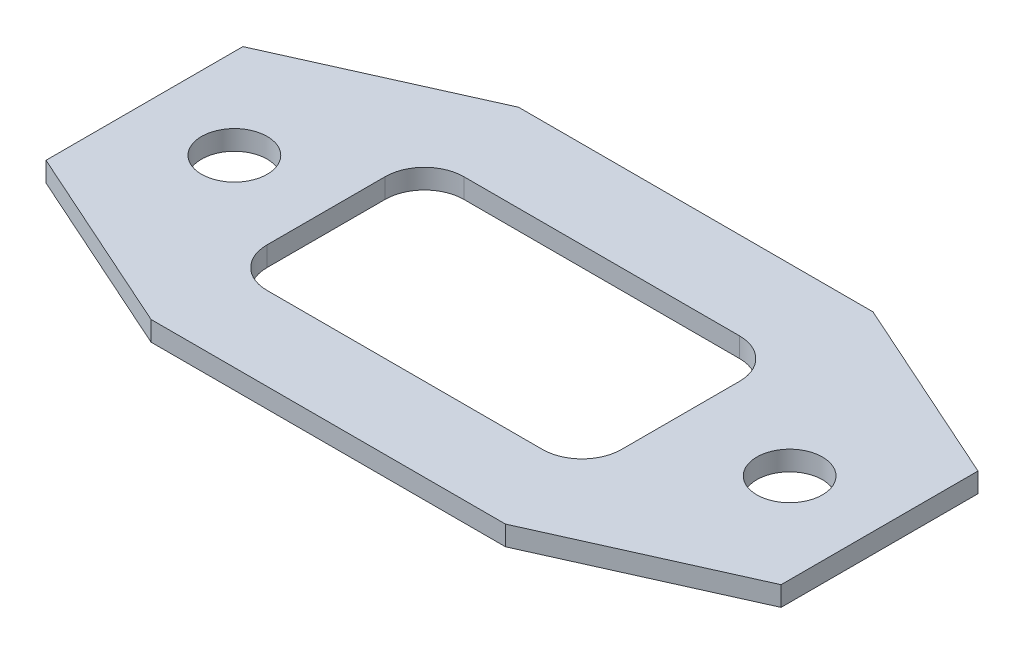
ISO-10303-21;
HEADER;
FILE_DESCRIPTION(('STEP AP214'),'2;1');
FILE_NAME('part.step','',(''),(''),'','','');
FILE_SCHEMA(('AUTOMOTIVE_DESIGN { 1 0 10303 214 1 1 1 1 }'));
ENDSEC;
DATA;
#1=APPLICATION_CONTEXT('core data for automotive mechanical design processes');
#2=APPLICATION_PROTOCOL_DEFINITION('international standard','automotive_design',2000,#1);
#3=PRODUCT_CONTEXT('',#1,'mechanical');
#4=PRODUCT('Part','Part','',(#3));
#5=PRODUCT_RELATED_PRODUCT_CATEGORY('part','',(#4));
#6=PRODUCT_DEFINITION_FORMATION('','',#4);
#7=PRODUCT_DEFINITION_CONTEXT('part definition',#1,'design');
#8=PRODUCT_DEFINITION('design','',#6,#7);
#9=PRODUCT_DEFINITION_SHAPE('','',#8);
#10=(LENGTH_UNIT() NAMED_UNIT(*) SI_UNIT(.MILLI.,.METRE.));
#11=(NAMED_UNIT(*) PLANE_ANGLE_UNIT() SI_UNIT($,.RADIAN.));
#12=(NAMED_UNIT(*) SI_UNIT($,.STERADIAN.) SOLID_ANGLE_UNIT());
#13=UNCERTAINTY_MEASURE_WITH_UNIT(LENGTH_MEASURE(1.E-05),#10,'distance_accuracy_value','');
#14=(GEOMETRIC_REPRESENTATION_CONTEXT(3) GLOBAL_UNCERTAINTY_ASSIGNED_CONTEXT((#13)) GLOBAL_UNIT_ASSIGNED_CONTEXT((#10,
#11,#12)) REPRESENTATION_CONTEXT('',''));
#15=CARTESIAN_POINT('',(0.,0.,0.));
#16=DIRECTION('',(0.,0.,1.));
#17=DIRECTION('',(1.,0.,0.));
#18=AXIS2_PLACEMENT_3D('',#15,#16,#17);
#19=CARTESIAN_POINT('',(0.,1.5,0.));
#20=DIRECTION('',(0.,1.,0.));
#21=DIRECTION('',(0.,0.,1.));
#22=AXIS2_PLACEMENT_3D('',#19,#20,#21);
#23=PLANE('',#22);
#24=CARTESIAN_POINT('',(21.15,1.5,0.));
#25=DIRECTION('',(0.,1.,0.));
#26=DIRECTION('',(0.,0.,1.));
#27=AXIS2_PLACEMENT_3D('',#24,#25,#26);
#28=CIRCLE('',#27,2.50000000000001);
#29=CARTESIAN_POINT('',(21.15,1.5,2.50000000000001));
#30=VERTEX_POINT('',#29);
#31=EDGE_CURVE('E185',#30,#30,#28,.T.);
#32=ORIENTED_EDGE('',*,*,#31,.F.);
#33=EDGE_LOOP('',(#32));
#34=FACE_BOUND('',#33,.T.);
#35=DIRECTION('',(-0.912509324514951,0.,0.409055904092909));
#36=VECTOR('',#35,1.);
#37=CARTESIAN_POINT('',(-13.5,1.5,-14.));
#38=LINE('',#37,#36);
#39=CARTESIAN_POINT('',(-13.5,1.5,-14.));
#40=VERTEX_POINT('',#39);
#41=CARTESIAN_POINT('',(-28.,1.5,-7.5));
#42=VERTEX_POINT('',#41);
#43=EDGE_CURVE('E215',#40,#42,#38,.T.);
#44=ORIENTED_EDGE('',*,*,#43,.T.);
#45=DIRECTION('',(0.,0.,1.));
#46=VECTOR('',#45,1.);
#47=CARTESIAN_POINT('',(-28.,1.5,-7.5));
#48=LINE('',#47,#46);
#49=CARTESIAN_POINT('',(-28.,1.5,7.5));
#50=VERTEX_POINT('',#49);
#51=EDGE_CURVE('E218',#42,#50,#48,.T.);
#52=ORIENTED_EDGE('',*,*,#51,.T.);
#53=DIRECTION('',(0.912509324514951,0.,0.409055904092909));
#54=VECTOR('',#53,1.);
#55=CARTESIAN_POINT('',(-13.5,1.5,14.));
#56=LINE('',#55,#54);
#57=CARTESIAN_POINT('',(-13.5,1.5,14.));
#58=VERTEX_POINT('',#57);
#59=EDGE_CURVE('E221',#50,#58,#56,.T.);
#60=ORIENTED_EDGE('',*,*,#59,.T.);
#61=DIRECTION('',(1.,0.,0.));
#62=VECTOR('',#61,1.);
#63=CARTESIAN_POINT('',(-13.5,1.5,14.));
#64=LINE('',#63,#62);
#65=CARTESIAN_POINT('',(13.5,1.5,14.));
#66=VERTEX_POINT('',#65);
#67=EDGE_CURVE('E223',#58,#66,#64,.T.);
#68=ORIENTED_EDGE('',*,*,#67,.T.);
#69=DIRECTION('',(0.912509324514951,0.,-0.409055904092909));
#70=VECTOR('',#69,1.);
#71=CARTESIAN_POINT('',(13.5,1.5,14.));
#72=LINE('',#71,#70);
#73=CARTESIAN_POINT('',(28.,1.5,7.5));
#74=VERTEX_POINT('',#73);
#75=EDGE_CURVE('E225',#66,#74,#72,.T.);
#76=ORIENTED_EDGE('',*,*,#75,.T.);
#77=DIRECTION('',(0.,0.,-1.));
#78=VECTOR('',#77,1.);
#79=CARTESIAN_POINT('',(28.,1.5,-7.5));
#80=LINE('',#79,#78);
#81=CARTESIAN_POINT('',(28.,1.5,-7.5));
#82=VERTEX_POINT('',#81);
#83=EDGE_CURVE('E227',#74,#82,#80,.T.);
#84=ORIENTED_EDGE('',*,*,#83,.T.);
#85=DIRECTION('',(-0.912509324514951,0.,-0.409055904092909));
#86=VECTOR('',#85,1.);
#87=CARTESIAN_POINT('',(13.5,1.5,-14.));
#88=LINE('',#87,#86);
#89=CARTESIAN_POINT('',(13.5,1.5,-14.));
#90=VERTEX_POINT('',#89);
#91=EDGE_CURVE('E229',#82,#90,#88,.T.);
#92=ORIENTED_EDGE('',*,*,#91,.T.);
#93=DIRECTION('',(-1.,0.,0.));
#94=VECTOR('',#93,1.);
#95=CARTESIAN_POINT('',(-13.5,1.5,-14.));
#96=LINE('',#95,#94);
#97=EDGE_CURVE('E231',#90,#40,#96,.T.);
#98=ORIENTED_EDGE('',*,*,#97,.T.);
#99=EDGE_LOOP('',(#44,#52,#60,#68,#76,#84,#92,#98));
#100=FACE_BOUND('',#99,.T.);
#101=DIRECTION('',(-1.,0.,0.));
#102=VECTOR('',#101,1.);
#103=CARTESIAN_POINT('',(-11.,1.5,-7.33368340575071));
#104=LINE('',#103,#102);
#105=CARTESIAN_POINT('',(9.99999999999998,1.5,-7.33368340575071));
#106=VERTEX_POINT('',#105);
#107=CARTESIAN_POINT('',(-11.,1.5,-7.33368340575071));
#108=VERTEX_POINT('',#107);
#109=EDGE_CURVE('E155',#106,#108,#104,.T.);
#110=ORIENTED_EDGE('',*,*,#109,.F.);
#111=CARTESIAN_POINT('',(10.,1.5,-4.3336834057507));
#112=DIRECTION('',(0.,1.,0.));
#113=DIRECTION('',(0.,0.,1.));
#114=AXIS2_PLACEMENT_3D('',#111,#112,#113);
#115=CIRCLE('',#114,3.);
#116=CARTESIAN_POINT('',(13.,1.5,-4.33368340575068));
#117=VERTEX_POINT('',#116);
#118=EDGE_CURVE('E147',#117,#106,#115,.T.);
#119=ORIENTED_EDGE('',*,*,#118,.F.);
#120=DIRECTION('',(0.,0.,-1.));
#121=VECTOR('',#120,1.);
#122=CARTESIAN_POINT('',(13.,1.5,-4.33368340575068));
#123=LINE('',#122,#121);
#124=CARTESIAN_POINT('',(13.,1.5,4.66631659424928));
#125=VERTEX_POINT('',#124);
#126=EDGE_CURVE('E182',#125,#117,#123,.T.);
#127=ORIENTED_EDGE('',*,*,#126,.F.);
#128=CARTESIAN_POINT('',(10.,1.5,4.6663165942493));
#129=DIRECTION('',(0.,1.,0.));
#130=DIRECTION('',(0.,0.,1.));
#131=AXIS2_PLACEMENT_3D('',#128,#129,#130);
#132=CIRCLE('',#131,3.);
#133=CARTESIAN_POINT('',(9.99999999999997,1.5,7.6663165942493));
#134=VERTEX_POINT('',#133);
#135=EDGE_CURVE('E180',#134,#125,#132,.T.);
#136=ORIENTED_EDGE('',*,*,#135,.F.);
#137=DIRECTION('',(1.,0.,0.));
#138=VECTOR('',#137,1.);
#139=CARTESIAN_POINT('',(9.99999999999997,1.5,7.66631659424929));
#140=LINE('',#139,#138);
#141=CARTESIAN_POINT('',(-11.,1.5,7.66631659424929));
#142=VERTEX_POINT('',#141);
#143=EDGE_CURVE('E178',#142,#134,#140,.T.);
#144=ORIENTED_EDGE('',*,*,#143,.F.);
#145=CARTESIAN_POINT('',(-11.,1.5,4.66631659424929));
#146=DIRECTION('',(0.,1.,0.));
#147=DIRECTION('',(0.,0.,1.));
#148=AXIS2_PLACEMENT_3D('',#145,#146,#147);
#149=CIRCLE('',#148,3.);
#150=CARTESIAN_POINT('',(-14.,1.5,4.66631659424927));
#151=VERTEX_POINT('',#150);
#152=EDGE_CURVE('E176',#151,#142,#149,.T.);
#153=ORIENTED_EDGE('',*,*,#152,.F.);
#154=DIRECTION('',(0.,0.,1.));
#155=VECTOR('',#154,1.);
#156=CARTESIAN_POINT('',(-14.,1.5,4.66631659424927));
#157=LINE('',#156,#155);
#158=CARTESIAN_POINT('',(-14.,1.5,-4.33368340575069));
#159=VERTEX_POINT('',#158);
#160=EDGE_CURVE('E171',#159,#151,#157,.T.);
#161=ORIENTED_EDGE('',*,*,#160,.F.);
#162=CARTESIAN_POINT('',(-11.,1.5,-4.33368340575071));
#163=DIRECTION('',(0.,1.,0.));
#164=DIRECTION('',(0.,0.,1.));
#165=AXIS2_PLACEMENT_3D('',#162,#163,#164);
#166=CIRCLE('',#165,3.);
#167=EDGE_CURVE('E169',#108,#159,#166,.T.);
#168=ORIENTED_EDGE('',*,*,#167,.F.);
#169=EDGE_LOOP('',(#110,#119,#127,#136,#144,#153,#161,#168));
#170=FACE_BOUND('',#169,.T.);
#171=CARTESIAN_POINT('',(-21.15,1.5,0.));
#172=DIRECTION('',(0.,1.,0.));
#173=DIRECTION('',(0.,0.,1.));
#174=AXIS2_PLACEMENT_3D('',#171,#172,#173);
#175=CIRCLE('',#174,2.50000000000001);
#176=CARTESIAN_POINT('',(-21.15,1.5,2.50000000000001));
#177=VERTEX_POINT('',#176);
#178=EDGE_CURVE('E371',#177,#177,#175,.T.);
#179=ORIENTED_EDGE('',*,*,#178,.F.);
#180=EDGE_LOOP('',(#179));
#181=FACE_BOUND('',#180,.T.);
#182=ADVANCED_FACE('F34',(#34,#100,#170,#181),#23,.T.);
#183=CARTESIAN_POINT('',(0.,0.,0.));
#184=DIRECTION('',(0.,1.,0.));
#185=DIRECTION('',(0.,0.,1.));
#186=AXIS2_PLACEMENT_3D('',#183,#184,#185);
#187=PLANE('',#186);
#188=DIRECTION('',(-0.912509324514951,0.,0.409055904092909));
#189=VECTOR('',#188,1.);
#190=CARTESIAN_POINT('',(-13.5,0.,-14.));
#191=LINE('',#190,#189);
#192=CARTESIAN_POINT('',(-13.5,0.,-14.));
#193=VERTEX_POINT('',#192);
#194=CARTESIAN_POINT('',(-28.,0.,-7.5));
#195=VERTEX_POINT('',#194);
#196=EDGE_CURVE('E163',#193,#195,#191,.T.);
#197=ORIENTED_EDGE('',*,*,#196,.F.);
#198=DIRECTION('',(-1.,0.,0.));
#199=VECTOR('',#198,1.);
#200=CARTESIAN_POINT('',(-13.5,0.,-14.));
#201=LINE('',#200,#199);
#202=CARTESIAN_POINT('',(13.5,0.,-14.));
#203=VERTEX_POINT('',#202);
#204=EDGE_CURVE('E219',#203,#193,#201,.T.);
#205=ORIENTED_EDGE('',*,*,#204,.F.);
#206=DIRECTION('',(-0.912509324514951,0.,-0.409055904092909));
#207=VECTOR('',#206,1.);
#208=CARTESIAN_POINT('',(13.5,0.,-14.));
#209=LINE('',#208,#207);
#210=CARTESIAN_POINT('',(28.,0.,-7.5));
#211=VERTEX_POINT('',#210);
#212=EDGE_CURVE('E246',#211,#203,#209,.T.);
#213=ORIENTED_EDGE('',*,*,#212,.F.);
#214=DIRECTION('',(0.,0.,-1.));
#215=VECTOR('',#214,1.);
#216=CARTESIAN_POINT('',(28.,0.,-7.5));
#217=LINE('',#216,#215);
#218=CARTESIAN_POINT('',(28.,0.,7.5));
#219=VERTEX_POINT('',#218);
#220=EDGE_CURVE('E244',#219,#211,#217,.T.);
#221=ORIENTED_EDGE('',*,*,#220,.F.);
#222=DIRECTION('',(0.912509324514951,0.,-0.409055904092909));
#223=VECTOR('',#222,1.);
#224=CARTESIAN_POINT('',(13.5,0.,14.));
#225=LINE('',#224,#223);
#226=CARTESIAN_POINT('',(13.5,0.,14.));
#227=VERTEX_POINT('',#226);
#228=EDGE_CURVE('E242',#227,#219,#225,.T.);
#229=ORIENTED_EDGE('',*,*,#228,.F.);
#230=DIRECTION('',(1.,0.,0.));
#231=VECTOR('',#230,1.);
#232=CARTESIAN_POINT('',(-13.5,0.,14.));
#233=LINE('',#232,#231);
#234=CARTESIAN_POINT('',(-13.5,0.,14.));
#235=VERTEX_POINT('',#234);
#236=EDGE_CURVE('E240',#235,#227,#233,.T.);
#237=ORIENTED_EDGE('',*,*,#236,.F.);
#238=DIRECTION('',(0.912509324514951,0.,0.409055904092909));
#239=VECTOR('',#238,1.);
#240=CARTESIAN_POINT('',(-13.5,0.,14.));
#241=LINE('',#240,#239);
#242=CARTESIAN_POINT('',(-28.,0.,7.5));
#243=VERTEX_POINT('',#242);
#244=EDGE_CURVE('E238',#243,#235,#241,.T.);
#245=ORIENTED_EDGE('',*,*,#244,.F.);
#246=DIRECTION('',(0.,0.,1.));
#247=VECTOR('',#246,1.);
#248=CARTESIAN_POINT('',(-28.,0.,-7.5));
#249=LINE('',#248,#247);
#250=EDGE_CURVE('E236',#195,#243,#249,.T.);
#251=ORIENTED_EDGE('',*,*,#250,.F.);
#252=EDGE_LOOP('',(#197,#205,#213,#221,#229,#237,#245,#251));
#253=FACE_BOUND('',#252,.T.);
#254=CARTESIAN_POINT('',(10.,0.,-4.3336834057507));
#255=DIRECTION('',(0.,1.,0.));
#256=DIRECTION('',(0.,0.,1.));
#257=AXIS2_PLACEMENT_3D('',#254,#255,#256);
#258=CIRCLE('',#257,3.);
#259=CARTESIAN_POINT('',(13.,0.,-4.33368340575068));
#260=VERTEX_POINT('',#259);
#261=CARTESIAN_POINT('',(9.99999999999998,0.,-7.33368340575071));
#262=VERTEX_POINT('',#261);
#263=EDGE_CURVE('E57',#260,#262,#258,.T.);
#264=ORIENTED_EDGE('',*,*,#263,.T.);
#265=DIRECTION('',(-1.,0.,0.));
#266=VECTOR('',#265,1.);
#267=CARTESIAN_POINT('',(-11.,0.,-7.33368340575071));
#268=LINE('',#267,#266);
#269=CARTESIAN_POINT('',(-11.,0.,-7.33368340575071));
#270=VERTEX_POINT('',#269);
#271=EDGE_CURVE('E162',#262,#270,#268,.T.);
#272=ORIENTED_EDGE('',*,*,#271,.T.);
#273=CARTESIAN_POINT('',(-11.,0.,-4.33368340575071));
#274=DIRECTION('',(0.,1.,0.));
#275=DIRECTION('',(0.,0.,1.));
#276=AXIS2_PLACEMENT_3D('',#273,#274,#275);
#277=CIRCLE('',#276,3.);
#278=CARTESIAN_POINT('',(-14.,0.,-4.33368340575069));
#279=VERTEX_POINT('',#278);
#280=EDGE_CURVE('E187',#270,#279,#277,.T.);
#281=ORIENTED_EDGE('',*,*,#280,.T.);
#282=DIRECTION('',(0.,0.,1.));
#283=VECTOR('',#282,1.);
#284=CARTESIAN_POINT('',(-14.,0.,4.66631659424927));
#285=LINE('',#284,#283);
#286=CARTESIAN_POINT('',(-14.,0.,4.66631659424927));
#287=VERTEX_POINT('',#286);
#288=EDGE_CURVE('E190',#279,#287,#285,.T.);
#289=ORIENTED_EDGE('',*,*,#288,.T.);
#290=CARTESIAN_POINT('',(-11.,0.,4.66631659424929));
#291=DIRECTION('',(0.,1.,0.));
#292=DIRECTION('',(0.,0.,1.));
#293=AXIS2_PLACEMENT_3D('',#290,#291,#292);
#294=CIRCLE('',#293,3.);
#295=CARTESIAN_POINT('',(-11.,0.,7.66631659424929));
#296=VERTEX_POINT('',#295);
#297=EDGE_CURVE('E193',#287,#296,#294,.T.);
#298=ORIENTED_EDGE('',*,*,#297,.T.);
#299=DIRECTION('',(1.,0.,0.));
#300=VECTOR('',#299,1.);
#301=CARTESIAN_POINT('',(9.99999999999997,0.,7.66631659424929));
#302=LINE('',#301,#300);
#303=CARTESIAN_POINT('',(9.99999999999997,0.,7.6663165942493));
#304=VERTEX_POINT('',#303);
#305=EDGE_CURVE('E196',#296,#304,#302,.T.);
#306=ORIENTED_EDGE('',*,*,#305,.T.);
#307=CARTESIAN_POINT('',(10.,0.,4.6663165942493));
#308=DIRECTION('',(0.,1.,0.));
#309=DIRECTION('',(0.,0.,1.));
#310=AXIS2_PLACEMENT_3D('',#307,#308,#309);
#311=CIRCLE('',#310,3.);
#312=CARTESIAN_POINT('',(13.,0.,4.66631659424928));
#313=VERTEX_POINT('',#312);
#314=EDGE_CURVE('E199',#304,#313,#311,.T.);
#315=ORIENTED_EDGE('',*,*,#314,.T.);
#316=DIRECTION('',(0.,0.,-1.));
#317=VECTOR('',#316,1.);
#318=CARTESIAN_POINT('',(13.,0.,-4.33368340575068));
#319=LINE('',#318,#317);
#320=EDGE_CURVE('E156',#313,#260,#319,.T.);
#321=ORIENTED_EDGE('',*,*,#320,.T.);
#322=EDGE_LOOP('',(#264,#272,#281,#289,#298,#306,#315,#321));
#323=FACE_BOUND('',#322,.T.);
#324=CARTESIAN_POINT('',(21.15,0.,0.));
#325=DIRECTION('',(0.,1.,0.));
#326=DIRECTION('',(0.,0.,1.));
#327=AXIS2_PLACEMENT_3D('',#324,#325,#326);
#328=CIRCLE('',#327,2.50000000000001);
#329=CARTESIAN_POINT('',(21.15,0.,2.50000000000001));
#330=VERTEX_POINT('',#329);
#331=EDGE_CURVE('E377',#330,#330,#328,.T.);
#332=ORIENTED_EDGE('',*,*,#331,.T.);
#333=EDGE_LOOP('',(#332));
#334=FACE_BOUND('',#333,.T.);
#335=CARTESIAN_POINT('',(-21.15,0.,0.));
#336=DIRECTION('',(0.,1.,0.));
#337=DIRECTION('',(0.,0.,1.));
#338=AXIS2_PLACEMENT_3D('',#335,#336,#337);
#339=CIRCLE('',#338,2.50000000000001);
#340=CARTESIAN_POINT('',(-21.15,0.,2.50000000000001));
#341=VERTEX_POINT('',#340);
#342=EDGE_CURVE('E374',#341,#341,#339,.T.);
#343=ORIENTED_EDGE('',*,*,#342,.T.);
#344=EDGE_LOOP('',(#343));
#345=FACE_BOUND('',#344,.T.);
#346=ADVANCED_FACE('F276',(#253,#323,#334,#345),#187,.F.);
#347=CARTESIAN_POINT('',(-13.5,1.5,-14.));
#348=DIRECTION('',(0.409055904092909,0.,0.912509324514951));
#349=DIRECTION('',(0.912509324514951,0.,-0.40905590409291));
#350=AXIS2_PLACEMENT_3D('',#347,#348,#349);
#351=PLANE('',#350);
#352=ORIENTED_EDGE('',*,*,#196,.T.);
#353=DIRECTION('',(0.,-1.,0.));
#354=VECTOR('',#353,1.);
#355=CARTESIAN_POINT('',(-28.,1.5,-7.5));
#356=LINE('',#355,#354);
#357=EDGE_CURVE('E11',#42,#195,#356,.T.);
#358=ORIENTED_EDGE('',*,*,#357,.F.);
#359=ORIENTED_EDGE('',*,*,#43,.F.);
#360=DIRECTION('',(0.,-1.,0.));
#361=VECTOR('',#360,1.);
#362=CARTESIAN_POINT('',(-13.5,1.5,-14.));
#363=LINE('',#362,#361);
#364=EDGE_CURVE('E233',#40,#193,#363,.T.);
#365=ORIENTED_EDGE('',*,*,#364,.T.);
#366=EDGE_LOOP('',(#352,#358,#359,#365));
#367=FACE_BOUND('',#366,.T.);
#368=ADVANCED_FACE('F36',(#367),#351,.F.);
#369=CARTESIAN_POINT('',(-28.,1.5,-7.5));
#370=DIRECTION('',(1.,0.,0.));
#371=DIRECTION('',(0.,0.,-1.));
#372=AXIS2_PLACEMENT_3D('',#369,#370,#371);
#373=PLANE('',#372);
#374=ORIENTED_EDGE('',*,*,#250,.T.);
#375=DIRECTION('',(0.,-1.,0.));
#376=VECTOR('',#375,1.);
#377=CARTESIAN_POINT('',(-28.,1.5,7.5));
#378=LINE('',#377,#376);
#379=EDGE_CURVE('E42',#50,#243,#378,.T.);
#380=ORIENTED_EDGE('',*,*,#379,.F.);
#381=ORIENTED_EDGE('',*,*,#51,.F.);
#382=ORIENTED_EDGE('',*,*,#357,.T.);
#383=EDGE_LOOP('',(#374,#380,#381,#382));
#384=FACE_BOUND('',#383,.T.);
#385=ADVANCED_FACE('F293',(#384),#373,.F.);
#386=CARTESIAN_POINT('',(-13.5,1.5,14.));
#387=DIRECTION('',(0.409055904092909,0.,-0.912509324514951));
#388=DIRECTION('',(-0.912509324514951,0.,-0.409055904092909));
#389=AXIS2_PLACEMENT_3D('',#386,#387,#388);
#390=PLANE('',#389);
#391=ORIENTED_EDGE('',*,*,#244,.T.);
#392=DIRECTION('',(0.,-1.,0.));
#393=VECTOR('',#392,1.);
#394=CARTESIAN_POINT('',(-13.5,1.5,14.));
#395=LINE('',#394,#393);
#396=EDGE_CURVE('E263',#58,#235,#395,.T.);
#397=ORIENTED_EDGE('',*,*,#396,.F.);
#398=ORIENTED_EDGE('',*,*,#59,.F.);
#399=ORIENTED_EDGE('',*,*,#379,.T.);
#400=EDGE_LOOP('',(#391,#397,#398,#399));
#401=FACE_BOUND('',#400,.T.);
#402=ADVANCED_FACE('F270',(#401),#390,.F.);
#403=CARTESIAN_POINT('',(-13.5,1.5,14.));
#404=DIRECTION('',(0.,0.,-1.));
#405=DIRECTION('',(-1.,0.,0.));
#406=AXIS2_PLACEMENT_3D('',#403,#404,#405);
#407=PLANE('',#406);
#408=ORIENTED_EDGE('',*,*,#236,.T.);
#409=DIRECTION('',(0.,-1.,0.));
#410=VECTOR('',#409,1.);
#411=CARTESIAN_POINT('',(13.5,1.5,14.));
#412=LINE('',#411,#410);
#413=EDGE_CURVE('E260',#66,#227,#412,.T.);
#414=ORIENTED_EDGE('',*,*,#413,.F.);
#415=ORIENTED_EDGE('',*,*,#67,.F.);
#416=ORIENTED_EDGE('',*,*,#396,.T.);
#417=EDGE_LOOP('',(#408,#414,#415,#416));
#418=FACE_BOUND('',#417,.T.);
#419=ADVANCED_FACE('F282',(#418),#407,.F.);
#420=CARTESIAN_POINT('',(13.5,1.5,14.));
#421=DIRECTION('',(-0.409055904092909,0.,-0.912509324514951));
#422=DIRECTION('',(-0.912509324514951,0.,0.40905590409291));
#423=AXIS2_PLACEMENT_3D('',#420,#421,#422);
#424=PLANE('',#423);
#425=ORIENTED_EDGE('',*,*,#228,.T.);
#426=DIRECTION('',(0.,-1.,0.));
#427=VECTOR('',#426,1.);
#428=CARTESIAN_POINT('',(28.,1.5,7.5));
#429=LINE('',#428,#427);
#430=EDGE_CURVE('E257',#74,#219,#429,.T.);
#431=ORIENTED_EDGE('',*,*,#430,.F.);
#432=ORIENTED_EDGE('',*,*,#75,.F.);
#433=ORIENTED_EDGE('',*,*,#413,.T.);
#434=EDGE_LOOP('',(#425,#431,#432,#433));
#435=FACE_BOUND('',#434,.T.);
#436=ADVANCED_FACE('F286',(#435),#424,.F.);
#437=CARTESIAN_POINT('',(28.,1.5,-7.5));
#438=DIRECTION('',(-1.,0.,0.));
#439=DIRECTION('',(0.,0.,1.));
#440=AXIS2_PLACEMENT_3D('',#437,#438,#439);
#441=PLANE('',#440);
#442=ORIENTED_EDGE('',*,*,#220,.T.);
#443=DIRECTION('',(0.,-1.,0.));
#444=VECTOR('',#443,1.);
#445=CARTESIAN_POINT('',(28.,1.5,-7.5));
#446=LINE('',#445,#444);
#447=EDGE_CURVE('E254',#82,#211,#446,.T.);
#448=ORIENTED_EDGE('',*,*,#447,.F.);
#449=ORIENTED_EDGE('',*,*,#83,.F.);
#450=ORIENTED_EDGE('',*,*,#430,.T.);
#451=EDGE_LOOP('',(#442,#448,#449,#450));
#452=FACE_BOUND('',#451,.T.);
#453=ADVANCED_FACE('F306',(#452),#441,.F.);
#454=CARTESIAN_POINT('',(13.5,1.5,-14.));
#455=DIRECTION('',(-0.409055904092909,0.,0.912509324514951));
#456=DIRECTION('',(0.912509324514951,0.,0.40905590409291));
#457=AXIS2_PLACEMENT_3D('',#454,#455,#456);
#458=PLANE('',#457);
#459=ORIENTED_EDGE('',*,*,#212,.T.);
#460=DIRECTION('',(0.,-1.,0.));
#461=VECTOR('',#460,1.);
#462=CARTESIAN_POINT('',(13.5,1.5,-14.));
#463=LINE('',#462,#461);
#464=EDGE_CURVE('E251',#90,#203,#463,.T.);
#465=ORIENTED_EDGE('',*,*,#464,.F.);
#466=ORIENTED_EDGE('',*,*,#91,.F.);
#467=ORIENTED_EDGE('',*,*,#447,.T.);
#468=EDGE_LOOP('',(#459,#465,#466,#467));
#469=FACE_BOUND('',#468,.T.);
#470=ADVANCED_FACE('F304',(#469),#458,.F.);
#471=CARTESIAN_POINT('',(-13.5,1.5,-14.));
#472=DIRECTION('',(0.,0.,1.));
#473=DIRECTION('',(1.,0.,0.));
#474=AXIS2_PLACEMENT_3D('',#471,#472,#473);
#475=PLANE('',#474);
#476=ORIENTED_EDGE('',*,*,#204,.T.);
#477=ORIENTED_EDGE('',*,*,#364,.F.);
#478=ORIENTED_EDGE('',*,*,#97,.F.);
#479=ORIENTED_EDGE('',*,*,#464,.T.);
#480=EDGE_LOOP('',(#476,#477,#478,#479));
#481=FACE_BOUND('',#480,.T.);
#482=ADVANCED_FACE('F299',(#481),#475,.F.);
#483=CARTESIAN_POINT('',(10.,1.5,-4.3336834057507));
#484=DIRECTION('',(0.,-1.,0.));
#485=DIRECTION('',(0.,0.,-1.));
#486=AXIS2_PLACEMENT_3D('',#483,#484,#485);
#487=CYLINDRICAL_SURFACE('',#486,3.);
#488=ORIENTED_EDGE('',*,*,#263,.F.);
#489=DIRECTION('',(0.,-1.,0.));
#490=VECTOR('',#489,1.);
#491=CARTESIAN_POINT('',(13.,1.5,-4.33368340575068));
#492=LINE('',#491,#490);
#493=EDGE_CURVE('E151',#117,#260,#492,.T.);
#494=ORIENTED_EDGE('',*,*,#493,.F.);
#495=ORIENTED_EDGE('',*,*,#118,.T.);
#496=DIRECTION('',(0.,-1.,0.));
#497=VECTOR('',#496,1.);
#498=CARTESIAN_POINT('',(9.99999999999998,1.5,-7.33368340575071));
#499=LINE('',#498,#497);
#500=EDGE_CURVE('E150',#106,#262,#499,.T.);
#501=ORIENTED_EDGE('',*,*,#500,.T.);
#502=EDGE_LOOP('',(#488,#494,#495,#501));
#503=FACE_BOUND('',#502,.T.);
#504=ADVANCED_FACE('F149',(#503),#487,.F.);
#505=CARTESIAN_POINT('',(-11.,1.5,-7.33368340575071));
#506=DIRECTION('',(0.,0.,1.));
#507=DIRECTION('',(1.,0.,0.));
#508=AXIS2_PLACEMENT_3D('',#505,#506,#507);
#509=PLANE('',#508);
#510=ORIENTED_EDGE('',*,*,#271,.F.);
#511=ORIENTED_EDGE('',*,*,#500,.F.);
#512=ORIENTED_EDGE('',*,*,#109,.T.);
#513=DIRECTION('',(0.,-1.,0.));
#514=VECTOR('',#513,1.);
#515=CARTESIAN_POINT('',(-11.,1.5,-7.33368340575071));
#516=LINE('',#515,#514);
#517=EDGE_CURVE('E164',#108,#270,#516,.T.);
#518=ORIENTED_EDGE('',*,*,#517,.T.);
#519=EDGE_LOOP('',(#510,#511,#512,#518));
#520=FACE_BOUND('',#519,.T.);
#521=ADVANCED_FACE('F159',(#520),#509,.T.);
#522=CARTESIAN_POINT('',(-11.,1.5,-4.33368340575071));
#523=DIRECTION('',(0.,-1.,0.));
#524=DIRECTION('',(0.,0.,-1.));
#525=AXIS2_PLACEMENT_3D('',#522,#523,#524);
#526=CYLINDRICAL_SURFACE('',#525,3.);
#527=ORIENTED_EDGE('',*,*,#280,.F.);
#528=ORIENTED_EDGE('',*,*,#517,.F.);
#529=ORIENTED_EDGE('',*,*,#167,.T.);
#530=DIRECTION('',(0.,-1.,0.));
#531=VECTOR('',#530,1.);
#532=CARTESIAN_POINT('',(-14.,1.5,-4.33368340575069));
#533=LINE('',#532,#531);
#534=EDGE_CURVE('E212',#159,#279,#533,.T.);
#535=ORIENTED_EDGE('',*,*,#534,.T.);
#536=EDGE_LOOP('',(#527,#528,#529,#535));
#537=FACE_BOUND('',#536,.T.);
#538=ADVANCED_FACE('F333',(#537),#526,.F.);
#539=CARTESIAN_POINT('',(-14.,1.5,4.66631659424927));
#540=DIRECTION('',(1.,0.,0.));
#541=DIRECTION('',(0.,0.,-1.));
#542=AXIS2_PLACEMENT_3D('',#539,#540,#541);
#543=PLANE('',#542);
#544=ORIENTED_EDGE('',*,*,#288,.F.);
#545=ORIENTED_EDGE('',*,*,#534,.F.);
#546=ORIENTED_EDGE('',*,*,#160,.T.);
#547=DIRECTION('',(0.,-1.,0.));
#548=VECTOR('',#547,1.);
#549=CARTESIAN_POINT('',(-14.,1.5,4.66631659424927));
#550=LINE('',#549,#548);
#551=EDGE_CURVE('E210',#151,#287,#550,.T.);
#552=ORIENTED_EDGE('',*,*,#551,.T.);
#553=EDGE_LOOP('',(#544,#545,#546,#552));
#554=FACE_BOUND('',#553,.T.);
#555=ADVANCED_FACE('F337',(#554),#543,.T.);
#556=CARTESIAN_POINT('',(-11.,1.5,4.66631659424929));
#557=DIRECTION('',(0.,-1.,0.));
#558=DIRECTION('',(0.,0.,-1.));
#559=AXIS2_PLACEMENT_3D('',#556,#557,#558);
#560=CYLINDRICAL_SURFACE('',#559,3.);
#561=ORIENTED_EDGE('',*,*,#297,.F.);
#562=ORIENTED_EDGE('',*,*,#551,.F.);
#563=ORIENTED_EDGE('',*,*,#152,.T.);
#564=DIRECTION('',(0.,-1.,0.));
#565=VECTOR('',#564,1.);
#566=CARTESIAN_POINT('',(-11.,1.5,7.66631659424929));
#567=LINE('',#566,#565);
#568=EDGE_CURVE('E208',#142,#296,#567,.T.);
#569=ORIENTED_EDGE('',*,*,#568,.T.);
#570=EDGE_LOOP('',(#561,#562,#563,#569));
#571=FACE_BOUND('',#570,.T.);
#572=ADVANCED_FACE('F343',(#571),#560,.F.);
#573=CARTESIAN_POINT('',(9.99999999999997,1.5,7.66631659424929));
#574=DIRECTION('',(0.,0.,-1.));
#575=DIRECTION('',(-1.,0.,0.));
#576=AXIS2_PLACEMENT_3D('',#573,#574,#575);
#577=PLANE('',#576);
#578=ORIENTED_EDGE('',*,*,#305,.F.);
#579=ORIENTED_EDGE('',*,*,#568,.F.);
#580=ORIENTED_EDGE('',*,*,#143,.T.);
#581=DIRECTION('',(0.,-1.,0.));
#582=VECTOR('',#581,1.);
#583=CARTESIAN_POINT('',(9.99999999999997,1.5,7.6663165942493));
#584=LINE('',#583,#582);
#585=EDGE_CURVE('E206',#134,#304,#584,.T.);
#586=ORIENTED_EDGE('',*,*,#585,.T.);
#587=EDGE_LOOP('',(#578,#579,#580,#586));
#588=FACE_BOUND('',#587,.T.);
#589=ADVANCED_FACE('F347',(#588),#577,.T.);
#590=CARTESIAN_POINT('',(10.,1.5,4.6663165942493));
#591=DIRECTION('',(0.,-1.,0.));
#592=DIRECTION('',(0.,0.,-1.));
#593=AXIS2_PLACEMENT_3D('',#590,#591,#592);
#594=CYLINDRICAL_SURFACE('',#593,3.);
#595=ORIENTED_EDGE('',*,*,#314,.F.);
#596=ORIENTED_EDGE('',*,*,#585,.F.);
#597=ORIENTED_EDGE('',*,*,#135,.T.);
#598=DIRECTION('',(0.,-1.,0.));
#599=VECTOR('',#598,1.);
#600=CARTESIAN_POINT('',(13.,1.5,4.66631659424928));
#601=LINE('',#600,#599);
#602=EDGE_CURVE('E49',#125,#313,#601,.T.);
#603=ORIENTED_EDGE('',*,*,#602,.T.);
#604=EDGE_LOOP('',(#595,#596,#597,#603));
#605=FACE_BOUND('',#604,.T.);
#606=ADVANCED_FACE('F351',(#605),#594,.F.);
#607=CARTESIAN_POINT('',(13.,1.5,-4.33368340575068));
#608=DIRECTION('',(-1.,0.,0.));
#609=DIRECTION('',(0.,0.,1.));
#610=AXIS2_PLACEMENT_3D('',#607,#608,#609);
#611=PLANE('',#610);
#612=ORIENTED_EDGE('',*,*,#320,.F.);
#613=ORIENTED_EDGE('',*,*,#602,.F.);
#614=ORIENTED_EDGE('',*,*,#126,.T.);
#615=ORIENTED_EDGE('',*,*,#493,.T.);
#616=EDGE_LOOP('',(#612,#613,#614,#615));
#617=FACE_BOUND('',#616,.T.);
#618=ADVANCED_FACE('F355',(#617),#611,.T.);
#619=CARTESIAN_POINT('',(21.15,1.5,0.));
#620=DIRECTION('',(0.,-1.,0.));
#621=DIRECTION('',(0.,0.,-1.));
#622=AXIS2_PLACEMENT_3D('',#619,#620,#621);
#623=CYLINDRICAL_SURFACE('',#622,2.50000000000001);
#624=ORIENTED_EDGE('',*,*,#31,.T.);
#625=EDGE_LOOP('',(#624));
#626=FACE_BOUND('',#625,.T.);
#627=ORIENTED_EDGE('',*,*,#331,.F.);
#628=EDGE_LOOP('',(#627));
#629=FACE_BOUND('',#628,.T.);
#630=ADVANCED_FACE('F359',(#626,#629),#623,.F.);
#631=CARTESIAN_POINT('',(-21.15,1.5,0.));
#632=DIRECTION('',(0.,-1.,0.));
#633=DIRECTION('',(0.,0.,-1.));
#634=AXIS2_PLACEMENT_3D('',#631,#632,#633);
#635=CYLINDRICAL_SURFACE('',#634,2.50000000000001);
#636=ORIENTED_EDGE('',*,*,#178,.T.);
#637=EDGE_LOOP('',(#636));
#638=FACE_BOUND('',#637,.T.);
#639=ORIENTED_EDGE('',*,*,#342,.F.);
#640=EDGE_LOOP('',(#639));
#641=FACE_BOUND('',#640,.T.);
#642=ADVANCED_FACE('F362',(#638,#641),#635,.F.);
#643=CLOSED_SHELL('',(#182,#346,#368,#385,#402,#419,#436,#453,#470,#482,#504,#521,#538,#555,
#572,#589,#606,#618,#630,#642));
#644=MANIFOLD_SOLID_BREP('B2',#643);
#645=ADVANCED_BREP_SHAPE_REPRESENTATION('',(#18,#644),#14);
#646=SHAPE_DEFINITION_REPRESENTATION(#9,#645);
ENDSEC;
END-ISO-10303-21;
